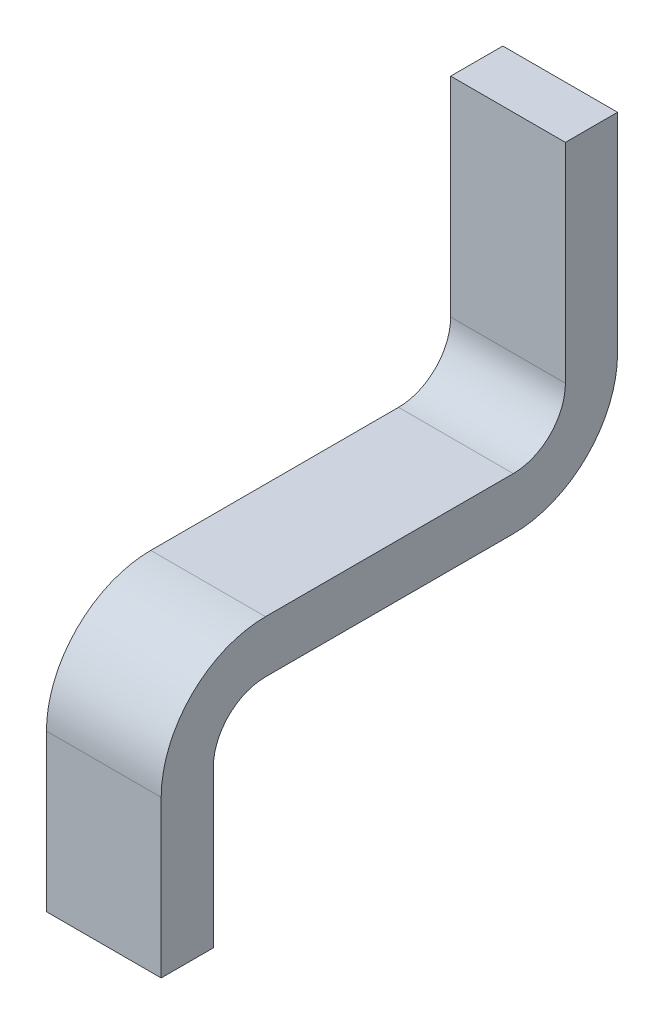
ISO-10303-21;
HEADER;
FILE_DESCRIPTION(('STEP AP214'),'2;1');
FILE_NAME('part.step','',(''),(''),'','','');
FILE_SCHEMA(('AUTOMOTIVE_DESIGN { 1 0 10303 214 1 1 1 1 }'));
ENDSEC;
DATA;
#1=APPLICATION_CONTEXT('core data for automotive mechanical design processes');
#2=APPLICATION_PROTOCOL_DEFINITION('international standard','automotive_design',2000,#1);
#3=PRODUCT_CONTEXT('',#1,'mechanical');
#4=PRODUCT('Part','Part','',(#3));
#5=PRODUCT_RELATED_PRODUCT_CATEGORY('part','',(#4));
#6=PRODUCT_DEFINITION_FORMATION('','',#4);
#7=PRODUCT_DEFINITION_CONTEXT('part definition',#1,'design');
#8=PRODUCT_DEFINITION('design','',#6,#7);
#9=PRODUCT_DEFINITION_SHAPE('','',#8);
#10=(LENGTH_UNIT() NAMED_UNIT(*) SI_UNIT(.MILLI.,.METRE.));
#11=(NAMED_UNIT(*) PLANE_ANGLE_UNIT() SI_UNIT($,.RADIAN.));
#12=(NAMED_UNIT(*) SI_UNIT($,.STERADIAN.) SOLID_ANGLE_UNIT());
#13=UNCERTAINTY_MEASURE_WITH_UNIT(LENGTH_MEASURE(1.E-05),#10,'distance_accuracy_value','');
#14=(GEOMETRIC_REPRESENTATION_CONTEXT(3) GLOBAL_UNCERTAINTY_ASSIGNED_CONTEXT((#13)) GLOBAL_UNIT_ASSIGNED_CONTEXT((#10,
#11,#12)) REPRESENTATION_CONTEXT('',''));
#15=CARTESIAN_POINT('',(0.,0.,0.));
#16=DIRECTION('',(0.,0.,1.));
#17=DIRECTION('',(1.,0.,0.));
#18=AXIS2_PLACEMENT_3D('',#15,#16,#17);
#19=CARTESIAN_POINT('',(-0.64,4.,0.675));
#20=DIRECTION('',(-1.,0.,0.));
#21=DIRECTION('',(0.,-1.,0.));
#22=AXIS2_PLACEMENT_3D('',#19,#20,#21);
#23=PLANE('',#22);
#24=CARTESIAN_POINT('',(-0.640000000000001,3.8,0.675));
#25=DIRECTION('',(1.,0.,0.));
#26=DIRECTION('',(0.,1.,0.));
#27=AXIS2_PLACEMENT_3D('',#24,#25,#26);
#28=CIRCLE('',#27,0.2);
#29=CARTESIAN_POINT('',(-0.640000000000001,3.8,0.875));
#30=VERTEX_POINT('',#29);
#31=CARTESIAN_POINT('',(-0.64,4.,0.675));
#32=VERTEX_POINT('',#31);
#33=EDGE_CURVE('E150',#30,#32,#28,.F.);
#34=ORIENTED_EDGE('',*,*,#33,.F.);
#35=DIRECTION('',(0.,1.,0.));
#36=VECTOR('',#35,1.);
#37=CARTESIAN_POINT('',(-0.64,3.50000000000001,0.875));
#38=LINE('',#37,#36);
#39=CARTESIAN_POINT('',(-0.64,3.50000000000001,0.875));
#40=VERTEX_POINT('',#39);
#41=EDGE_CURVE('E147',#30,#40,#38,.F.);
#42=ORIENTED_EDGE('',*,*,#41,.T.);
#43=DIRECTION('',(0.,0.,1.));
#44=VECTOR('',#43,1.);
#45=CARTESIAN_POINT('',(-0.64,3.50000000000001,0.775));
#46=LINE('',#45,#44);
#47=CARTESIAN_POINT('',(-0.64,3.50000000000001,0.775));
#48=VERTEX_POINT('',#47);
#49=EDGE_CURVE('E141',#48,#40,#46,.T.);
#50=ORIENTED_EDGE('',*,*,#49,.F.);
#51=DIRECTION('',(0.,1.,0.));
#52=VECTOR('',#51,1.);
#53=CARTESIAN_POINT('',(-0.64,3.50000000000001,0.775));
#54=LINE('',#53,#52);
#55=CARTESIAN_POINT('',(-0.640000000000001,3.8,0.775));
#56=VERTEX_POINT('',#55);
#57=EDGE_CURVE('E115',#48,#56,#54,.T.);
#58=ORIENTED_EDGE('',*,*,#57,.T.);
#59=CARTESIAN_POINT('',(-0.640000000000001,3.8,0.675));
#60=DIRECTION('',(1.,0.,0.));
#61=DIRECTION('',(0.,1.,0.));
#62=AXIS2_PLACEMENT_3D('',#59,#60,#61);
#63=CIRCLE('',#62,0.1);
#64=CARTESIAN_POINT('',(-0.640000000000001,3.90000000000001,0.675));
#65=VERTEX_POINT('',#64);
#66=EDGE_CURVE('E215',#56,#65,#63,.F.);
#67=ORIENTED_EDGE('',*,*,#66,.T.);
#68=DIRECTION('',(0.,0.,1.));
#69=VECTOR('',#68,1.);
#70=CARTESIAN_POINT('',(-0.640000000000001,3.90000000000001,0.675));
#71=LINE('',#70,#69);
#72=CARTESIAN_POINT('',(-0.640000000000001,3.90000000000001,0.2));
#73=VERTEX_POINT('',#72);
#74=EDGE_CURVE('E181',#65,#73,#71,.F.);
#75=ORIENTED_EDGE('',*,*,#74,.T.);
#76=CARTESIAN_POINT('',(-0.64,4.1,0.2));
#77=DIRECTION('',(-1.,0.,0.));
#78=DIRECTION('',(0.,-1.,0.));
#79=AXIS2_PLACEMENT_3D('',#76,#77,#78);
#80=CIRCLE('',#79,0.2);
#81=CARTESIAN_POINT('',(-0.64,4.1,0.));
#82=VERTEX_POINT('',#81);
#83=EDGE_CURVE('E20',#82,#73,#80,.T.);
#84=ORIENTED_EDGE('',*,*,#83,.F.);
#85=DIRECTION('',(0.,1.,0.));
#86=VECTOR('',#85,1.);
#87=CARTESIAN_POINT('',(-0.64,4.1,0.));
#88=LINE('',#87,#86);
#89=CARTESIAN_POINT('',(-0.64,4.5,0.));
#90=VERTEX_POINT('',#89);
#91=EDGE_CURVE('E91',#82,#90,#88,.T.);
#92=ORIENTED_EDGE('',*,*,#91,.T.);
#93=DIRECTION('',(0.,0.,1.));
#94=VECTOR('',#93,1.);
#95=CARTESIAN_POINT('',(-0.64,4.5,0.));
#96=LINE('',#95,#94);
#97=CARTESIAN_POINT('',(-0.64,4.5,0.1));
#98=VERTEX_POINT('',#97);
#99=EDGE_CURVE('E163',#90,#98,#96,.T.);
#100=ORIENTED_EDGE('',*,*,#99,.T.);
#101=DIRECTION('',(0.,1.,0.));
#102=VECTOR('',#101,1.);
#103=CARTESIAN_POINT('',(-0.64,4.1,0.1));
#104=LINE('',#103,#102);
#105=CARTESIAN_POINT('',(-0.64,4.1,0.1));
#106=VERTEX_POINT('',#105);
#107=EDGE_CURVE('E159',#98,#106,#104,.F.);
#108=ORIENTED_EDGE('',*,*,#107,.T.);
#109=CARTESIAN_POINT('',(-0.64,4.1,0.2));
#110=DIRECTION('',(-1.,0.,0.));
#111=DIRECTION('',(0.,-1.,0.));
#112=AXIS2_PLACEMENT_3D('',#109,#110,#111);
#113=CIRCLE('',#112,0.1);
#114=CARTESIAN_POINT('',(-0.64,4.,0.2));
#115=VERTEX_POINT('',#114);
#116=EDGE_CURVE('E155',#106,#115,#113,.T.);
#117=ORIENTED_EDGE('',*,*,#116,.T.);
#118=DIRECTION('',(0.,0.,1.));
#119=VECTOR('',#118,1.);
#120=CARTESIAN_POINT('',(-0.64,4.,0.675));
#121=LINE('',#120,#119);
#122=EDGE_CURVE('E154',#115,#32,#121,.T.);
#123=ORIENTED_EDGE('',*,*,#122,.T.);
#124=EDGE_LOOP('',(#34,#42,#50,#58,#67,#75,#84,#92,#100,#108,#117,#123));
#125=FACE_BOUND('',#124,.T.);
#126=ADVANCED_FACE('F17',(#125),#23,.F.);
#127=CARTESIAN_POINT('',(-0.64,4.1,0.2));
#128=DIRECTION('',(-1.,0.,0.));
#129=DIRECTION('',(0.,-1.,0.));
#130=AXIS2_PLACEMENT_3D('',#127,#128,#129);
#131=CYLINDRICAL_SURFACE('',#130,0.2);
#132=CARTESIAN_POINT('',(-0.86,4.1,0.2));
#133=DIRECTION('',(-1.,0.,0.));
#134=DIRECTION('',(0.,-1.,0.));
#135=AXIS2_PLACEMENT_3D('',#132,#133,#134);
#136=CIRCLE('',#135,0.2);
#137=CARTESIAN_POINT('',(-0.860000000000001,3.90000000000001,0.2));
#138=VERTEX_POINT('',#137);
#139=CARTESIAN_POINT('',(-0.86,4.1,0.));
#140=VERTEX_POINT('',#139);
#141=EDGE_CURVE('E183',#138,#140,#136,.F.);
#142=ORIENTED_EDGE('',*,*,#141,.T.);
#143=DIRECTION('',(1.,0.,0.));
#144=VECTOR('',#143,1.);
#145=CARTESIAN_POINT('',(-0.64,4.1,0.));
#146=LINE('',#145,#144);
#147=EDGE_CURVE('E178',#140,#82,#146,.T.);
#148=ORIENTED_EDGE('',*,*,#147,.T.);
#149=ORIENTED_EDGE('',*,*,#83,.T.);
#150=DIRECTION('',(-1.,0.,0.));
#151=VECTOR('',#150,1.);
#152=CARTESIAN_POINT('',(-0.640000000000001,3.90000000000001,0.2));
#153=LINE('',#152,#151);
#154=EDGE_CURVE('E217',#73,#138,#153,.T.);
#155=ORIENTED_EDGE('',*,*,#154,.T.);
#156=EDGE_LOOP('',(#142,#148,#149,#155));
#157=FACE_BOUND('',#156,.T.);
#158=ADVANCED_FACE('F254',(#157),#131,.T.);
#159=CARTESIAN_POINT('',(-0.64,4.1,0.));
#160=DIRECTION('',(0.,0.,1.));
#161=DIRECTION('',(1.,0.,0.));
#162=AXIS2_PLACEMENT_3D('',#159,#160,#161);
#163=PLANE('',#162);
#164=ORIENTED_EDGE('',*,*,#147,.F.);
#165=DIRECTION('',(0.,1.,0.));
#166=VECTOR('',#165,1.);
#167=CARTESIAN_POINT('',(-0.860000000000001,3.90000000000001,0.));
#168=LINE('',#167,#166);
#169=CARTESIAN_POINT('',(-0.86,4.5,0.));
#170=VERTEX_POINT('',#169);
#171=EDGE_CURVE('E170',#140,#170,#168,.T.);
#172=ORIENTED_EDGE('',*,*,#171,.T.);
#173=DIRECTION('',(1.,0.,0.));
#174=VECTOR('',#173,1.);
#175=CARTESIAN_POINT('',(-0.64,4.5,0.));
#176=LINE('',#175,#174);
#177=EDGE_CURVE('E173',#170,#90,#176,.T.);
#178=ORIENTED_EDGE('',*,*,#177,.T.);
#179=ORIENTED_EDGE('',*,*,#91,.F.);
#180=EDGE_LOOP('',(#164,#172,#178,#179));
#181=FACE_BOUND('',#180,.T.);
#182=ADVANCED_FACE('F257',(#181),#163,.F.);
#183=CARTESIAN_POINT('',(-0.64,4.5,0.));
#184=DIRECTION('',(0.,-1.,0.));
#185=DIRECTION('',(1.,0.,0.));
#186=AXIS2_PLACEMENT_3D('',#183,#184,#185);
#187=PLANE('',#186);
#188=DIRECTION('',(-1.,0.,0.));
#189=VECTOR('',#188,1.);
#190=CARTESIAN_POINT('',(-0.86,4.5,0.1));
#191=LINE('',#190,#189);
#192=CARTESIAN_POINT('',(-0.86,4.5,0.1));
#193=VERTEX_POINT('',#192);
#194=EDGE_CURVE('E160',#193,#98,#191,.F.);
#195=ORIENTED_EDGE('',*,*,#194,.T.);
#196=ORIENTED_EDGE('',*,*,#99,.F.);
#197=ORIENTED_EDGE('',*,*,#177,.F.);
#198=DIRECTION('',(0.,0.,1.));
#199=VECTOR('',#198,1.);
#200=CARTESIAN_POINT('',(-0.86,4.5,0.675));
#201=LINE('',#200,#199);
#202=EDGE_CURVE('E166',#170,#193,#201,.T.);
#203=ORIENTED_EDGE('',*,*,#202,.T.);
#204=EDGE_LOOP('',(#195,#196,#197,#203));
#205=FACE_BOUND('',#204,.T.);
#206=ADVANCED_FACE('F259',(#205),#187,.F.);
#207=CARTESIAN_POINT('',(-0.86,4.1,0.1));
#208=DIRECTION('',(0.,0.,-1.));
#209=DIRECTION('',(-1.,0.,0.));
#210=AXIS2_PLACEMENT_3D('',#207,#208,#209);
#211=PLANE('',#210);
#212=DIRECTION('',(-1.,0.,0.));
#213=VECTOR('',#212,1.);
#214=CARTESIAN_POINT('',(-0.86,4.1,0.1));
#215=LINE('',#214,#213);
#216=CARTESIAN_POINT('',(-0.86,4.1,0.1));
#217=VERTEX_POINT('',#216);
#218=EDGE_CURVE('E156',#217,#106,#215,.F.);
#219=ORIENTED_EDGE('',*,*,#218,.T.);
#220=ORIENTED_EDGE('',*,*,#107,.F.);
#221=ORIENTED_EDGE('',*,*,#194,.F.);
#222=DIRECTION('',(0.,1.,0.));
#223=VECTOR('',#222,1.);
#224=CARTESIAN_POINT('',(-0.860000000000001,3.90000000000001,0.1));
#225=LINE('',#224,#223);
#226=EDGE_CURVE('E169',#193,#217,#225,.F.);
#227=ORIENTED_EDGE('',*,*,#226,.T.);
#228=EDGE_LOOP('',(#219,#220,#221,#227));
#229=FACE_BOUND('',#228,.T.);
#230=ADVANCED_FACE('F234',(#229),#211,.F.);
#231=CARTESIAN_POINT('',(-0.86,4.1,0.2));
#232=DIRECTION('',(-1.,0.,0.));
#233=DIRECTION('',(0.,-1.,0.));
#234=AXIS2_PLACEMENT_3D('',#231,#232,#233);
#235=CYLINDRICAL_SURFACE('',#234,0.1);
#236=DIRECTION('',(1.,0.,0.));
#237=VECTOR('',#236,1.);
#238=CARTESIAN_POINT('',(-0.86,4.,0.2));
#239=LINE('',#238,#237);
#240=CARTESIAN_POINT('',(-0.86,4.,0.2));
#241=VERTEX_POINT('',#240);
#242=EDGE_CURVE('E151',#241,#115,#239,.T.);
#243=ORIENTED_EDGE('',*,*,#242,.T.);
#244=ORIENTED_EDGE('',*,*,#116,.F.);
#245=ORIENTED_EDGE('',*,*,#218,.F.);
#246=CARTESIAN_POINT('',(-0.86,4.1,0.2));
#247=DIRECTION('',(-1.,0.,0.));
#248=DIRECTION('',(0.,-1.,0.));
#249=AXIS2_PLACEMENT_3D('',#246,#247,#248);
#250=CIRCLE('',#249,0.1);
#251=EDGE_CURVE('E210',#217,#241,#250,.T.);
#252=ORIENTED_EDGE('',*,*,#251,.T.);
#253=EDGE_LOOP('',(#243,#244,#245,#252));
#254=FACE_BOUND('',#253,.T.);
#255=ADVANCED_FACE('F227',(#254),#235,.F.);
#256=CARTESIAN_POINT('',(-0.86,4.,0.675));
#257=DIRECTION('',(0.,-1.,0.));
#258=DIRECTION('',(1.,0.,0.));
#259=AXIS2_PLACEMENT_3D('',#256,#257,#258);
#260=PLANE('',#259);
#261=DIRECTION('',(1.,0.,0.));
#262=VECTOR('',#261,1.);
#263=CARTESIAN_POINT('',(-0.86,4.,0.675));
#264=LINE('',#263,#262);
#265=CARTESIAN_POINT('',(-0.86,4.,0.675));
#266=VERTEX_POINT('',#265);
#267=EDGE_CURVE('E148',#32,#266,#264,.F.);
#268=ORIENTED_EDGE('',*,*,#267,.F.);
#269=ORIENTED_EDGE('',*,*,#122,.F.);
#270=ORIENTED_EDGE('',*,*,#242,.F.);
#271=DIRECTION('',(0.,0.,1.));
#272=VECTOR('',#271,1.);
#273=CARTESIAN_POINT('',(-0.86,4.,0.675));
#274=LINE('',#273,#272);
#275=EDGE_CURVE('E209',#241,#266,#274,.T.);
#276=ORIENTED_EDGE('',*,*,#275,.T.);
#277=EDGE_LOOP('',(#268,#269,#270,#276));
#278=FACE_BOUND('',#277,.T.);
#279=ADVANCED_FACE('F224',(#278),#260,.F.);
#280=CARTESIAN_POINT('',(-0.860000000000001,3.8,0.675));
#281=DIRECTION('',(1.,0.,0.));
#282=DIRECTION('',(0.,1.,0.));
#283=AXIS2_PLACEMENT_3D('',#280,#281,#282);
#284=CYLINDRICAL_SURFACE('',#283,0.2);
#285=ORIENTED_EDGE('',*,*,#33,.T.);
#286=ORIENTED_EDGE('',*,*,#267,.T.);
#287=CARTESIAN_POINT('',(-0.860000000000001,3.8,0.675));
#288=DIRECTION('',(1.,0.,0.));
#289=DIRECTION('',(0.,1.,0.));
#290=AXIS2_PLACEMENT_3D('',#287,#288,#289);
#291=CIRCLE('',#290,0.2);
#292=CARTESIAN_POINT('',(-0.860000000000001,3.8,0.875));
#293=VERTEX_POINT('',#292);
#294=EDGE_CURVE('E133',#266,#293,#291,.T.);
#295=ORIENTED_EDGE('',*,*,#294,.T.);
#296=DIRECTION('',(-1.,0.,0.));
#297=VECTOR('',#296,1.);
#298=CARTESIAN_POINT('',(-0.860000000000001,3.8,0.875));
#299=LINE('',#298,#297);
#300=EDGE_CURVE('E144',#293,#30,#299,.F.);
#301=ORIENTED_EDGE('',*,*,#300,.T.);
#302=EDGE_LOOP('',(#285,#286,#295,#301));
#303=FACE_BOUND('',#302,.T.);
#304=ADVANCED_FACE('F285',(#303),#284,.T.);
#305=CARTESIAN_POINT('',(-0.86,3.50000000000001,0.875));
#306=DIRECTION('',(0.,0.,-1.));
#307=DIRECTION('',(-1.,0.,0.));
#308=AXIS2_PLACEMENT_3D('',#305,#306,#307);
#309=PLANE('',#308);
#310=DIRECTION('',(1.,0.,0.));
#311=VECTOR('',#310,1.);
#312=CARTESIAN_POINT('',(-0.64,3.50000000000001,0.875));
#313=LINE('',#312,#311);
#314=CARTESIAN_POINT('',(-0.86,3.50000000000001,0.875));
#315=VERTEX_POINT('',#314);
#316=EDGE_CURVE('E118',#40,#315,#313,.F.);
#317=ORIENTED_EDGE('',*,*,#316,.F.);
#318=ORIENTED_EDGE('',*,*,#41,.F.);
#319=ORIENTED_EDGE('',*,*,#300,.F.);
#320=DIRECTION('',(0.,1.,0.));
#321=VECTOR('',#320,1.);
#322=CARTESIAN_POINT('',(-0.860000000000001,3.90000000000001,0.875));
#323=LINE('',#322,#321);
#324=EDGE_CURVE('E131',#293,#315,#323,.F.);
#325=ORIENTED_EDGE('',*,*,#324,.T.);
#326=EDGE_LOOP('',(#317,#318,#319,#325));
#327=FACE_BOUND('',#326,.T.);
#328=ADVANCED_FACE('F282',(#327),#309,.F.);
#329=CARTESIAN_POINT('',(-0.64,3.50000000000001,0.775));
#330=DIRECTION('',(0.,-1.,0.));
#331=DIRECTION('',(1.,0.,0.));
#332=AXIS2_PLACEMENT_3D('',#329,#330,#331);
#333=PLANE('',#332);
#334=ORIENTED_EDGE('',*,*,#49,.T.);
#335=ORIENTED_EDGE('',*,*,#316,.T.);
#336=DIRECTION('',(0.,0.,1.));
#337=VECTOR('',#336,1.);
#338=CARTESIAN_POINT('',(-0.86,3.50000000000001,0.675));
#339=LINE('',#338,#337);
#340=CARTESIAN_POINT('',(-0.86,3.50000000000001,0.775));
#341=VERTEX_POINT('',#340);
#342=EDGE_CURVE('E125',#315,#341,#339,.F.);
#343=ORIENTED_EDGE('',*,*,#342,.T.);
#344=DIRECTION('',(1.,0.,0.));
#345=VECTOR('',#344,1.);
#346=CARTESIAN_POINT('',(-0.64,3.50000000000001,0.775));
#347=LINE('',#346,#345);
#348=EDGE_CURVE('E110',#341,#48,#347,.T.);
#349=ORIENTED_EDGE('',*,*,#348,.T.);
#350=EDGE_LOOP('',(#334,#335,#343,#349));
#351=FACE_BOUND('',#350,.T.);
#352=ADVANCED_FACE('F129',(#351),#333,.T.);
#353=CARTESIAN_POINT('',(-0.64,3.50000000000001,0.775));
#354=DIRECTION('',(0.,0.,1.));
#355=DIRECTION('',(1.,0.,0.));
#356=AXIS2_PLACEMENT_3D('',#353,#354,#355);
#357=PLANE('',#356);
#358=ORIENTED_EDGE('',*,*,#348,.F.);
#359=DIRECTION('',(0.,1.,0.));
#360=VECTOR('',#359,1.);
#361=CARTESIAN_POINT('',(-0.860000000000001,3.90000000000001,0.775));
#362=LINE('',#361,#360);
#363=CARTESIAN_POINT('',(-0.860000000000001,3.8,0.775));
#364=VERTEX_POINT('',#363);
#365=EDGE_CURVE('E114',#341,#364,#362,.T.);
#366=ORIENTED_EDGE('',*,*,#365,.T.);
#367=DIRECTION('',(1.,0.,0.));
#368=VECTOR('',#367,1.);
#369=CARTESIAN_POINT('',(-0.640000000000001,3.8,0.775));
#370=LINE('',#369,#368);
#371=EDGE_CURVE('E185',#364,#56,#370,.T.);
#372=ORIENTED_EDGE('',*,*,#371,.T.);
#373=ORIENTED_EDGE('',*,*,#57,.F.);
#374=EDGE_LOOP('',(#358,#366,#372,#373));
#375=FACE_BOUND('',#374,.T.);
#376=ADVANCED_FACE('F112',(#375),#357,.F.);
#377=CARTESIAN_POINT('',(-0.640000000000001,3.8,0.675));
#378=DIRECTION('',(1.,0.,0.));
#379=DIRECTION('',(0.,1.,0.));
#380=AXIS2_PLACEMENT_3D('',#377,#378,#379);
#381=CYLINDRICAL_SURFACE('',#380,0.1);
#382=ORIENTED_EDGE('',*,*,#371,.F.);
#383=CARTESIAN_POINT('',(-0.860000000000001,3.8,0.675));
#384=DIRECTION('',(1.,0.,0.));
#385=DIRECTION('',(0.,1.,0.));
#386=AXIS2_PLACEMENT_3D('',#383,#384,#385);
#387=CIRCLE('',#386,0.1);
#388=CARTESIAN_POINT('',(-0.860000000000001,3.90000000000001,0.675));
#389=VERTEX_POINT('',#388);
#390=EDGE_CURVE('E26',#364,#389,#387,.F.);
#391=ORIENTED_EDGE('',*,*,#390,.T.);
#392=DIRECTION('',(-1.,0.,0.));
#393=VECTOR('',#392,1.);
#394=CARTESIAN_POINT('',(-0.640000000000001,3.90000000000001,0.675));
#395=LINE('',#394,#393);
#396=EDGE_CURVE('E34',#389,#65,#395,.F.);
#397=ORIENTED_EDGE('',*,*,#396,.T.);
#398=ORIENTED_EDGE('',*,*,#66,.F.);
#399=EDGE_LOOP('',(#382,#391,#397,#398));
#400=FACE_BOUND('',#399,.T.);
#401=ADVANCED_FACE('F250',(#400),#381,.F.);
#402=CARTESIAN_POINT('',(-0.640000000000001,3.90000000000001,0.675));
#403=DIRECTION('',(0.,1.,0.));
#404=DIRECTION('',(-1.,0.,0.));
#405=AXIS2_PLACEMENT_3D('',#402,#403,#404);
#406=PLANE('',#405);
#407=ORIENTED_EDGE('',*,*,#396,.F.);
#408=DIRECTION('',(0.,0.,1.));
#409=VECTOR('',#408,1.);
#410=CARTESIAN_POINT('',(-0.860000000000001,3.90000000000001,0.675));
#411=LINE('',#410,#409);
#412=EDGE_CURVE('E11',#389,#138,#411,.F.);
#413=ORIENTED_EDGE('',*,*,#412,.T.);
#414=ORIENTED_EDGE('',*,*,#154,.F.);
#415=ORIENTED_EDGE('',*,*,#74,.F.);
#416=EDGE_LOOP('',(#407,#413,#414,#415));
#417=FACE_BOUND('',#416,.T.);
#418=ADVANCED_FACE('F252',(#417),#406,.F.);
#419=CARTESIAN_POINT('',(-0.860000000000001,3.90000000000001,0.675));
#420=DIRECTION('',(1.,0.,0.));
#421=DIRECTION('',(0.,1.,0.));
#422=AXIS2_PLACEMENT_3D('',#419,#420,#421);
#423=PLANE('',#422);
#424=ORIENTED_EDGE('',*,*,#390,.F.);
#425=ORIENTED_EDGE('',*,*,#365,.F.);
#426=ORIENTED_EDGE('',*,*,#342,.F.);
#427=ORIENTED_EDGE('',*,*,#324,.F.);
#428=ORIENTED_EDGE('',*,*,#294,.F.);
#429=ORIENTED_EDGE('',*,*,#275,.F.);
#430=ORIENTED_EDGE('',*,*,#251,.F.);
#431=ORIENTED_EDGE('',*,*,#226,.F.);
#432=ORIENTED_EDGE('',*,*,#202,.F.);
#433=ORIENTED_EDGE('',*,*,#171,.F.);
#434=ORIENTED_EDGE('',*,*,#141,.F.);
#435=ORIENTED_EDGE('',*,*,#412,.F.);
#436=EDGE_LOOP('',(#424,#425,#426,#427,#428,#429,#430,#431,#432,#433,#434,#435));
#437=FACE_BOUND('',#436,.T.);
#438=ADVANCED_FACE('F123',(#437),#423,.F.);
#439=CLOSED_SHELL('',(#126,#158,#182,#206,#230,#255,#279,#304,#328,#352,#376,#401,#418,#438));
#440=MANIFOLD_SOLID_BREP('B1',#439);
#441=ADVANCED_BREP_SHAPE_REPRESENTATION('',(#18,#440),#14);
#442=SHAPE_DEFINITION_REPRESENTATION(#9,#441);
ENDSEC;
END-ISO-10303-21;
